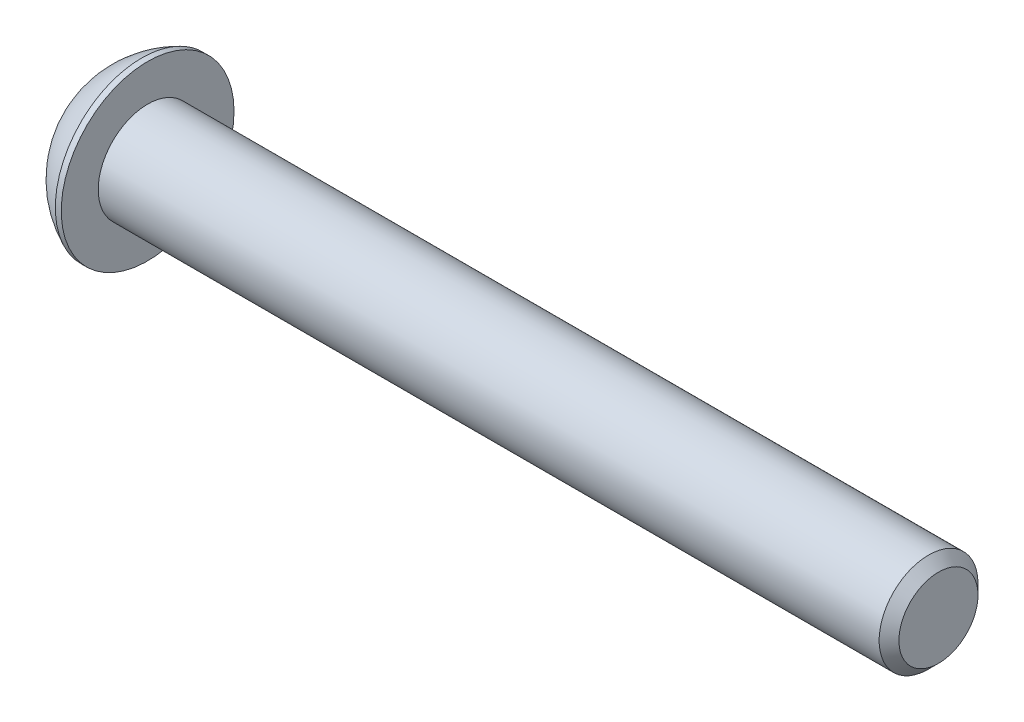
ISO-10303-21;
HEADER;
FILE_DESCRIPTION(('STEP AP214'),'2;1');
FILE_NAME('part.step','',(''),(''),'','','');
FILE_SCHEMA(('AUTOMOTIVE_DESIGN { 1 0 10303 214 1 1 1 1 }'));
ENDSEC;
DATA;
#1=APPLICATION_CONTEXT('core data for automotive mechanical design processes');
#2=APPLICATION_PROTOCOL_DEFINITION('international standard','automotive_design',2000,#1);
#3=PRODUCT_CONTEXT('',#1,'mechanical');
#4=PRODUCT('Part','Part','',(#3));
#5=PRODUCT_RELATED_PRODUCT_CATEGORY('part','',(#4));
#6=PRODUCT_DEFINITION_FORMATION('','',#4);
#7=PRODUCT_DEFINITION_CONTEXT('part definition',#1,'design');
#8=PRODUCT_DEFINITION('design','',#6,#7);
#9=PRODUCT_DEFINITION_SHAPE('','',#8);
#10=(LENGTH_UNIT() NAMED_UNIT(*) SI_UNIT(.MILLI.,.METRE.));
#11=(NAMED_UNIT(*) PLANE_ANGLE_UNIT() SI_UNIT($,.RADIAN.));
#12=(NAMED_UNIT(*) SI_UNIT($,.STERADIAN.) SOLID_ANGLE_UNIT());
#13=UNCERTAINTY_MEASURE_WITH_UNIT(LENGTH_MEASURE(1.E-05),#10,'distance_accuracy_value','');
#14=(GEOMETRIC_REPRESENTATION_CONTEXT(3) GLOBAL_UNCERTAINTY_ASSIGNED_CONTEXT((#13)) GLOBAL_UNIT_ASSIGNED_CONTEXT((#10,
#11,#12)) REPRESENTATION_CONTEXT('',''));
#15=CARTESIAN_POINT('',(0.,0.,0.));
#16=DIRECTION('',(0.,0.,1.));
#17=DIRECTION('',(1.,0.,0.));
#18=AXIS2_PLACEMENT_3D('',#15,#16,#17);
#19=CARTESIAN_POINT('',(1.32080000000034,0.,0.));
#20=DIRECTION('',(-1.,0.,0.));
#21=DIRECTION('',(0.,0.,-1.));
#22=AXIS2_PLACEMENT_3D('',#19,#20,#21);
#23=CONICAL_SURFACE('',#22,1.1937999999998,1.04719755119608);
#24=CARTESIAN_POINT('',(2.01004075135902,0.,4.44089209850063E-13));
#25=VERTEX_POINT('',#24);
#26=VERTEX_LOOP('',#25);
#27=FACE_BOUND('',#26,.T.);
#28=CARTESIAN_POINT('',(1.32080000000009,0.,0.));
#29=DIRECTION('',(1.,0.,0.));
#30=DIRECTION('',(0.,0.,-1.));
#31=AXIS2_PLACEMENT_3D('',#28,#29,#30);
#32=CIRCLE('',#31,1.19380000000024);
#33=CARTESIAN_POINT('',(1.32080000000009,0.,-1.19380000000024));
#34=VERTEX_POINT('',#33);
#35=EDGE_CURVE('E41',#34,#34,#32,.T.);
#36=ORIENTED_EDGE('',*,*,#35,.F.);
#37=EDGE_LOOP('',(#36));
#38=FACE_BOUND('',#37,.T.);
#39=ADVANCED_FACE('F38',(#27,#38),#23,.F.);
#40=CARTESIAN_POINT('',(1.3208,-2.29135888084633,0.));
#41=DIRECTION('',(1.,0.,0.));
#42=DIRECTION('',(0.,0.,1.));
#43=AXIS2_PLACEMENT_3D('',#40,#41,#42);
#44=PLANE('',#43);
#45=DIRECTION('',(0.,1.,0.));
#46=VECTOR('',#45,1.);
#47=CARTESIAN_POINT('',(1.3208,-1.14567944042316,-1.984375));
#48=LINE('',#47,#46);
#49=CARTESIAN_POINT('',(1.3208,1.14567944042316,-1.984375));
#50=VERTEX_POINT('',#49);
#51=CARTESIAN_POINT('',(1.3208,-1.14567944042316,-1.984375));
#52=VERTEX_POINT('',#51);
#53=EDGE_CURVE('E101',#50,#52,#48,.F.);
#54=ORIENTED_EDGE('',*,*,#53,.T.);
#55=DIRECTION('',(0.,0.500000000000001,-0.866025403784438));
#56=VECTOR('',#55,1.);
#57=CARTESIAN_POINT('',(1.3208,-2.29135888084633,0.));
#58=LINE('',#57,#56);
#59=CARTESIAN_POINT('',(1.3208,-2.29135888084633,0.));
#60=VERTEX_POINT('',#59);
#61=EDGE_CURVE('E107',#52,#60,#58,.F.);
#62=ORIENTED_EDGE('',*,*,#61,.T.);
#63=DIRECTION('',(0.,-0.500000000000001,-0.866025403784438));
#64=VECTOR('',#63,1.);
#65=CARTESIAN_POINT('',(1.3208,-1.14567944042316,1.984375));
#66=LINE('',#65,#64);
#67=CARTESIAN_POINT('',(1.3208,-1.14567944042316,1.984375));
#68=VERTEX_POINT('',#67);
#69=EDGE_CURVE('E171',#60,#68,#66,.F.);
#70=ORIENTED_EDGE('',*,*,#69,.T.);
#71=DIRECTION('',(0.,1.,0.));
#72=VECTOR('',#71,1.);
#73=CARTESIAN_POINT('',(1.3208,1.14567944042316,1.984375));
#74=LINE('',#73,#72);
#75=CARTESIAN_POINT('',(1.3208,1.14567944042316,1.984375));
#76=VERTEX_POINT('',#75);
#77=EDGE_CURVE('E166',#68,#76,#74,.T.);
#78=ORIENTED_EDGE('',*,*,#77,.T.);
#79=DIRECTION('',(0.,-0.5,0.866025403784439));
#80=VECTOR('',#79,1.);
#81=CARTESIAN_POINT('',(1.3208,2.29135888084633,0.));
#82=LINE('',#81,#80);
#83=CARTESIAN_POINT('',(1.3208,2.29135888084633,0.));
#84=VERTEX_POINT('',#83);
#85=EDGE_CURVE('E161',#76,#84,#82,.F.);
#86=ORIENTED_EDGE('',*,*,#85,.T.);
#87=DIRECTION('',(0.,0.5,0.866025403784439));
#88=VECTOR('',#87,1.);
#89=CARTESIAN_POINT('',(1.3208,1.14567944042316,-1.984375));
#90=LINE('',#89,#88);
#91=EDGE_CURVE('E157',#84,#50,#90,.F.);
#92=ORIENTED_EDGE('',*,*,#91,.T.);
#93=EDGE_LOOP('',(#54,#62,#70,#78,#86,#92));
#94=FACE_BOUND('',#93,.T.);
#95=ORIENTED_EDGE('',*,*,#35,.T.);
#96=EDGE_LOOP('',(#95));
#97=FACE_BOUND('',#96,.T.);
#98=ADVANCED_FACE('F97',(#94,#97),#44,.F.);
#99=CARTESIAN_POINT('',(1.3208,-1.14567944042316,-1.984375));
#100=DIRECTION('',(0.,0.,1.));
#101=DIRECTION('',(0.,1.,0.));
#102=AXIS2_PLACEMENT_3D('',#99,#100,#101);
#103=PLANE('',#102);
#104=ORIENTED_EDGE('',*,*,#53,.F.);
#105=DIRECTION('',(1.,0.,0.));
#106=VECTOR('',#105,1.);
#107=CARTESIAN_POINT('',(1.3208,1.14567944042316,-1.984375));
#108=LINE('',#107,#106);
#109=CARTESIAN_POINT('',(0.,1.14567944042316,-1.984375));
#110=VERTEX_POINT('',#109);
#111=EDGE_CURVE('E154',#50,#110,#108,.F.);
#112=ORIENTED_EDGE('',*,*,#111,.T.);
#113=DIRECTION('',(0.,1.,0.));
#114=VECTOR('',#113,1.);
#115=CARTESIAN_POINT('',(0.,0.,-1.984375));
#116=LINE('',#115,#114);
#117=CARTESIAN_POINT('',(0.,-1.14567944042316,-1.984375));
#118=VERTEX_POINT('',#117);
#119=EDGE_CURVE('E152',#110,#118,#116,.F.);
#120=ORIENTED_EDGE('',*,*,#119,.T.);
#121=DIRECTION('',(1.,0.,0.));
#122=VECTOR('',#121,1.);
#123=CARTESIAN_POINT('',(1.3208,-1.14567944042316,-1.984375));
#124=LINE('',#123,#122);
#125=EDGE_CURVE('E91',#118,#52,#124,.T.);
#126=ORIENTED_EDGE('',*,*,#125,.T.);
#127=EDGE_LOOP('',(#104,#112,#120,#126));
#128=FACE_BOUND('',#127,.T.);
#129=ADVANCED_FACE('F192',(#128),#103,.T.);
#130=CARTESIAN_POINT('',(1.3208,-2.29135888084633,0.));
#131=DIRECTION('',(0.,0.866025403784438,0.500000000000001));
#132=DIRECTION('',(0.,0.500000000000001,-0.866025403784438));
#133=AXIS2_PLACEMENT_3D('',#130,#131,#132);
#134=PLANE('',#133);
#135=ORIENTED_EDGE('',*,*,#61,.F.);
#136=ORIENTED_EDGE('',*,*,#125,.F.);
#137=DIRECTION('',(0.,-0.500000000000001,0.866025403784438));
#138=VECTOR('',#137,1.);
#139=CARTESIAN_POINT('',(0.,-1.14567944042316,-1.984375));
#140=LINE('',#139,#138);
#141=CARTESIAN_POINT('',(0.,-2.29135888084633,0.));
#142=VERTEX_POINT('',#141);
#143=EDGE_CURVE('E149',#118,#142,#140,.T.);
#144=ORIENTED_EDGE('',*,*,#143,.T.);
#145=DIRECTION('',(1.,0.,0.));
#146=VECTOR('',#145,1.);
#147=CARTESIAN_POINT('',(1.3208,-2.29135888084633,0.));
#148=LINE('',#147,#146);
#149=EDGE_CURVE('E174',#142,#60,#148,.T.);
#150=ORIENTED_EDGE('',*,*,#149,.T.);
#151=EDGE_LOOP('',(#135,#136,#144,#150));
#152=FACE_BOUND('',#151,.T.);
#153=ADVANCED_FACE('F177',(#152),#134,.T.);
#154=CARTESIAN_POINT('',(1.3208,-1.14567944042316,1.984375));
#155=DIRECTION('',(0.,0.866025403784438,-0.500000000000001));
#156=DIRECTION('',(0.,-0.500000000000001,-0.866025403784438));
#157=AXIS2_PLACEMENT_3D('',#154,#155,#156);
#158=PLANE('',#157);
#159=ORIENTED_EDGE('',*,*,#69,.F.);
#160=ORIENTED_EDGE('',*,*,#149,.F.);
#161=DIRECTION('',(0.,0.500000000000001,0.866025403784438));
#162=VECTOR('',#161,1.);
#163=CARTESIAN_POINT('',(0.,-2.29135888084633,0.));
#164=LINE('',#163,#162);
#165=CARTESIAN_POINT('',(0.,-1.14567944042316,1.984375));
#166=VERTEX_POINT('',#165);
#167=EDGE_CURVE('E146',#142,#166,#164,.T.);
#168=ORIENTED_EDGE('',*,*,#167,.T.);
#169=DIRECTION('',(1.,0.,0.));
#170=VECTOR('',#169,1.);
#171=CARTESIAN_POINT('',(1.3208,-1.14567944042316,1.984375));
#172=LINE('',#171,#170);
#173=EDGE_CURVE('E169',#166,#68,#172,.T.);
#174=ORIENTED_EDGE('',*,*,#173,.T.);
#175=EDGE_LOOP('',(#159,#160,#168,#174));
#176=FACE_BOUND('',#175,.T.);
#177=ADVANCED_FACE('F180',(#176),#158,.T.);
#178=CARTESIAN_POINT('',(1.3208,1.14567944042316,1.984375));
#179=DIRECTION('',(0.,0.,-1.));
#180=DIRECTION('',(1.,0.,0.));
#181=AXIS2_PLACEMENT_3D('',#178,#179,#180);
#182=PLANE('',#181);
#183=ORIENTED_EDGE('',*,*,#77,.F.);
#184=ORIENTED_EDGE('',*,*,#173,.F.);
#185=DIRECTION('',(0.,1.,0.));
#186=VECTOR('',#185,1.);
#187=CARTESIAN_POINT('',(0.,0.,1.984375));
#188=LINE('',#187,#186);
#189=CARTESIAN_POINT('',(0.,1.14567944042316,1.984375));
#190=VERTEX_POINT('',#189);
#191=EDGE_CURVE('E143',#166,#190,#188,.T.);
#192=ORIENTED_EDGE('',*,*,#191,.T.);
#193=DIRECTION('',(1.,0.,0.));
#194=VECTOR('',#193,1.);
#195=CARTESIAN_POINT('',(1.3208,1.14567944042316,1.984375));
#196=LINE('',#195,#194);
#197=EDGE_CURVE('E164',#190,#76,#196,.T.);
#198=ORIENTED_EDGE('',*,*,#197,.T.);
#199=EDGE_LOOP('',(#183,#184,#192,#198));
#200=FACE_BOUND('',#199,.T.);
#201=ADVANCED_FACE('F184',(#200),#182,.T.);
#202=CARTESIAN_POINT('',(1.3208,2.29135888084633,0.));
#203=DIRECTION('',(0.,-0.866025403784439,-0.5));
#204=DIRECTION('',(0.,-0.5,0.866025403784439));
#205=AXIS2_PLACEMENT_3D('',#202,#203,#204);
#206=PLANE('',#205);
#207=ORIENTED_EDGE('',*,*,#85,.F.);
#208=ORIENTED_EDGE('',*,*,#197,.F.);
#209=DIRECTION('',(0.,0.5,-0.866025403784439));
#210=VECTOR('',#209,1.);
#211=CARTESIAN_POINT('',(0.,1.14567944042316,1.984375));
#212=LINE('',#211,#210);
#213=CARTESIAN_POINT('',(0.,2.29135888084633,0.));
#214=VERTEX_POINT('',#213);
#215=EDGE_CURVE('E140',#190,#214,#212,.T.);
#216=ORIENTED_EDGE('',*,*,#215,.T.);
#217=DIRECTION('',(1.,0.,0.));
#218=VECTOR('',#217,1.);
#219=CARTESIAN_POINT('',(1.3208,2.29135888084633,0.));
#220=LINE('',#219,#218);
#221=EDGE_CURVE('E159',#214,#84,#220,.T.);
#222=ORIENTED_EDGE('',*,*,#221,.T.);
#223=EDGE_LOOP('',(#207,#208,#216,#222));
#224=FACE_BOUND('',#223,.T.);
#225=ADVANCED_FACE('F189',(#224),#206,.T.);
#226=CARTESIAN_POINT('',(1.3208,1.14567944042316,-1.984375));
#227=DIRECTION('',(0.,-0.866025403784439,0.5));
#228=DIRECTION('',(0.,0.5,0.866025403784439));
#229=AXIS2_PLACEMENT_3D('',#226,#227,#228);
#230=PLANE('',#229);
#231=ORIENTED_EDGE('',*,*,#91,.F.);
#232=ORIENTED_EDGE('',*,*,#221,.F.);
#233=DIRECTION('',(0.,-0.5,-0.866025403784438));
#234=VECTOR('',#233,1.);
#235=CARTESIAN_POINT('',(0.,2.29135888084633,0.));
#236=LINE('',#235,#234);
#237=EDGE_CURVE('E56',#214,#110,#236,.T.);
#238=ORIENTED_EDGE('',*,*,#237,.T.);
#239=ORIENTED_EDGE('',*,*,#111,.F.);
#240=EDGE_LOOP('',(#231,#232,#238,#239));
#241=FACE_BOUND('',#240,.T.);
#242=ADVANCED_FACE('F191',(#241),#230,.T.);
#243=CARTESIAN_POINT('',(0.,0.,0.));
#244=DIRECTION('',(-1.,0.,0.));
#245=DIRECTION('',(0.,0.,-1.));
#246=AXIS2_PLACEMENT_3D('',#243,#244,#245);
#247=PLANE('',#246);
#248=ORIENTED_EDGE('',*,*,#215,.F.);
#249=ORIENTED_EDGE('',*,*,#191,.F.);
#250=ORIENTED_EDGE('',*,*,#167,.F.);
#251=ORIENTED_EDGE('',*,*,#143,.F.);
#252=ORIENTED_EDGE('',*,*,#119,.F.);
#253=ORIENTED_EDGE('',*,*,#237,.F.);
#254=EDGE_LOOP('',(#248,#249,#250,#251,#252,#253));
#255=FACE_BOUND('',#254,.T.);
#256=CARTESIAN_POINT('',(0.,2.77495,0.));
#257=CARTESIAN_POINT('',(0.,2.77494953309947,-0.077911893752346));
#258=CARTESIAN_POINT('',(0.,2.77166578388025,-0.15583810591977));
#259=CARTESIAN_POINT('',(0.,2.75855213600204,-0.311152012455904));
#260=CARTESIAN_POINT('',(0.,2.74872030471467,-0.388539541019556));
#261=CARTESIAN_POINT('',(0.,2.72255472645677,-0.542341518735718));
#262=CARTESIAN_POINT('',(-2.70111753942276E-13,2.70621065843662,-0.618754223567578));
#263=CARTESIAN_POINT('',(2.71199122712048E-13,2.66713326915777,-0.769973634286023));
#264=CARTESIAN_POINT('',(1.01140160355389E-12,2.64439476297869,-0.844778983646282));
#265=CARTESIAN_POINT('',(1.81659311492368E-12,2.5669019594335,-1.06566239301792));
#266=CARTESIAN_POINT('',(4.76424972847466E-13,2.50280672569928,-1.20857954243987));
#267=CARTESIAN_POINT('',(-4.75575707467107E-13,2.35149826934097,-1.48160874561538));
#268=CARTESIAN_POINT('',(0.,2.26428416790396,-1.61172031233499));
#269=CARTESIAN_POINT('',(0.,2.1181093928834,-1.79445660654268));
#270=CARTESIAN_POINT('',(0.,2.06678693791626,-1.85333128513997));
#271=CARTESIAN_POINT('',(0.,1.95940522984449,-1.96650727912792));
#272=CARTESIAN_POINT('',(0.,1.90335059143535,-2.02081294920044));
#273=CARTESIAN_POINT('',(0.,1.78683891013962,-2.12453280878582));
#274=CARTESIAN_POINT('',(0.,1.72637988450322,-2.1739447713554));
#275=CARTESIAN_POINT('',(0.,1.6015196886571,-2.26750481692908));
#276=CARTESIAN_POINT('',(0.,1.53711760864537,-2.31165167810848));
#277=CARTESIAN_POINT('',(0.,1.33869902291632,-2.43567242603945));
#278=CARTESIAN_POINT('',(0.,1.19934704110695,-2.507235886628));
#279=CARTESIAN_POINT('',(0.,0.910681609121876,-2.62590828672821));
#280=CARTESIAN_POINT('',(0.,0.761368265357393,-2.67301748742279));
#281=CARTESIAN_POINT('',(0.,0.456932649466618,-2.74151230664007));
#282=CARTESIAN_POINT('',(0.,0.301810346322579,-2.76289778778721));
#283=CARTESIAN_POINT('',(0.,-0.00982263870895672,-2.77931595661156));
#284=CARTESIAN_POINT('',(0.,-0.166333320596453,-2.77434864428877));
#285=CARTESIAN_POINT('',(0.,-0.476280836814457,-2.73822217653073));
#286=CARTESIAN_POINT('',(0.,-0.62971768755599,-2.70706316096981));
#287=CARTESIAN_POINT('',(0.,-0.929254830044279,-2.6193798077115));
#288=CARTESIAN_POINT('',(0.,-1.0753550434132,-2.56285519909569));
#289=CARTESIAN_POINT('',(0.,-1.2857069259858,-2.46037024128109));
#290=CARTESIAN_POINT('',(0.,-1.35439130022287,-2.42323494812897));
#291=CARTESIAN_POINT('',(0.,-1.488391287199,-2.34331277270256));
#292=CARTESIAN_POINT('',(0.,-1.55370767631788,-2.30052720108832));
#293=CARTESIAN_POINT('',(0.,-1.68047292776595,-2.20962421887055));
#294=CARTESIAN_POINT('',(0.,-1.74192352786821,-2.16150923122349));
#295=CARTESIAN_POINT('',(0.,-1.86060297067993,-2.06024311301283));
#296=CARTESIAN_POINT('',(0.,-1.91782768181716,-2.00708716697631));
#297=CARTESIAN_POINT('',(0.,-2.08239462196652,-1.84072208565541));
#298=CARTESIAN_POINT('',(0.,-2.18279764272603,-1.72049499758423));
#299=CARTESIAN_POINT('',(0.,-2.36195754944064,-1.46487629213019));
#300=CARTESIAN_POINT('',(0.,-2.44071525816758,-1.32948525142808));
#301=CARTESIAN_POINT('',(0.,-2.54098882695275,-1.11796734074395));
#302=CARTESIAN_POINT('',(0.,-2.57146177392728,-1.04596540008348));
#303=CARTESIAN_POINT('',(0.,-2.62621251109,-0.899689259475771));
#304=CARTESIAN_POINT('',(0.,-2.65049531495565,-0.825416953360958));
#305=CARTESIAN_POINT('',(0.,-2.69267708798768,-0.675215808695211));
#306=CARTESIAN_POINT('',(0.,-2.71058613777938,-0.599289789313096));
#307=CARTESIAN_POINT('',(0.,-2.73994710360128,-0.446213628496935));
#308=CARTESIAN_POINT('',(0.,-2.75140092413872,-0.369063855024791));
#309=CARTESIAN_POINT('',(0.,-2.76470470685523,-0.243162088173433));
#310=CARTESIAN_POINT('',(0.,-2.76854547596619,-0.194611672428578));
#311=CARTESIAN_POINT('',(0.,-2.77366826843265,-0.097376035183982));
#312=CARTESIAN_POINT('',(0.,-2.77495029178815,-0.0486908136842399));
#313=CARTESIAN_POINT('',(0.,-2.77494953309948,0.0779118937523473));
#314=CARTESIAN_POINT('',(0.,-2.77166578388026,0.155838105919771));
#315=CARTESIAN_POINT('',(0.,-2.75855213600205,0.311152012455906));
#316=CARTESIAN_POINT('',(0.,-2.74872030471468,0.388539541019558));
#317=CARTESIAN_POINT('',(0.,-2.72255472645678,0.54234151873572));
#318=CARTESIAN_POINT('',(-2.70430332641579E-13,-2.70621065843663,0.618754223567581));
#319=CARTESIAN_POINT('',(2.71517960478941E-13,-2.66713326915778,0.769973634286026));
#320=CARTESIAN_POINT('',(1.01275560390505E-12,-2.6443947629787,0.844778983646286));
#321=CARTESIAN_POINT('',(1.81908746978714E-12,-2.56690195943352,1.06566239301793));
#322=CARTESIAN_POINT('',(4.77073664932017E-13,-2.50280672569929,1.20857954243988));
#323=CARTESIAN_POINT('',(-4.76224424213801E-13,-2.35149826934098,1.48160874561538));
#324=CARTESIAN_POINT('',(0.,-2.26428416790397,1.61172031233499));
#325=CARTESIAN_POINT('',(0.,-2.11810939288341,1.79445660654268));
#326=CARTESIAN_POINT('',(0.,-2.06678693791627,1.85333128513997));
#327=CARTESIAN_POINT('',(0.,-1.9594052298445,1.96650727912792));
#328=CARTESIAN_POINT('',(0.,-1.90335059143536,2.02081294920045));
#329=CARTESIAN_POINT('',(0.,-1.78683891013963,2.12453280878582));
#330=CARTESIAN_POINT('',(0.,-1.72637988450323,2.1739447713554));
#331=CARTESIAN_POINT('',(0.,-1.60151968865711,2.26750481692908));
#332=CARTESIAN_POINT('',(0.,-1.53711760864538,2.31165167810848));
#333=CARTESIAN_POINT('',(0.,-1.33869902291633,2.43567242603945));
#334=CARTESIAN_POINT('',(0.,-1.19934704110696,2.50723588662801));
#335=CARTESIAN_POINT('',(0.,-0.910681609121886,2.62590828672822));
#336=CARTESIAN_POINT('',(0.,-0.761368265357404,2.67301748742279));
#337=CARTESIAN_POINT('',(0.,-0.456932649466629,2.74151230664008));
#338=CARTESIAN_POINT('',(0.,-0.301810346322589,2.76289778778721));
#339=CARTESIAN_POINT('',(0.,0.00982263870894727,2.77931595661156));
#340=CARTESIAN_POINT('',(0.,0.166333320596444,2.77434864428877));
#341=CARTESIAN_POINT('',(0.,0.476280836814448,2.73822217653073));
#342=CARTESIAN_POINT('',(0.,0.629717687555981,2.70706316096981));
#343=CARTESIAN_POINT('',(0.,0.929254830044271,2.6193798077115));
#344=CARTESIAN_POINT('',(0.,1.07535504341319,2.56285519909569));
#345=CARTESIAN_POINT('',(0.,1.28570692598579,2.46037024128109));
#346=CARTESIAN_POINT('',(0.,1.35439130022286,2.42323494812896));
#347=CARTESIAN_POINT('',(0.,1.48839128719899,2.34331277270256));
#348=CARTESIAN_POINT('',(0.,1.55370767631787,2.30052720108832));
#349=CARTESIAN_POINT('',(0.,1.68047292776594,2.20962421887055));
#350=CARTESIAN_POINT('',(0.,1.7419235278682,2.16150923122349));
#351=CARTESIAN_POINT('',(0.,1.86060297067992,2.06024311301283));
#352=CARTESIAN_POINT('',(0.,1.91782768181715,2.0070871669763));
#353=CARTESIAN_POINT('',(0.,2.08239462196651,1.8407220856554));
#354=CARTESIAN_POINT('',(0.,2.18279764272601,1.72049499758422));
#355=CARTESIAN_POINT('',(0.,2.36195754944063,1.46487629213018));
#356=CARTESIAN_POINT('',(0.,2.44071525816758,1.32948525142808));
#357=CARTESIAN_POINT('',(0.,2.54098882695274,1.11796734074395));
#358=CARTESIAN_POINT('',(0.,2.57146177392727,1.04596540008348));
#359=CARTESIAN_POINT('',(0.,2.62621251108998,0.899689259475768));
#360=CARTESIAN_POINT('',(0.,2.65049531495563,0.825416953360955));
#361=CARTESIAN_POINT('',(0.,2.69267708798766,0.675215808695209));
#362=CARTESIAN_POINT('',(0.,2.71058613777937,0.599289789313094));
#363=CARTESIAN_POINT('',(0.,2.73994710360127,0.446213628496933));
#364=CARTESIAN_POINT('',(0.,2.7514009241387,0.369063855024788));
#365=CARTESIAN_POINT('',(0.,2.76470470685522,0.24316208817343));
#366=CARTESIAN_POINT('',(0.,2.76854547596618,0.194611672428576));
#367=CARTESIAN_POINT('',(0.,2.77366826843264,0.0973760351839819));
#368=CARTESIAN_POINT('',(0.,2.77495029178814,0.0486908136842405));
#369=CARTESIAN_POINT('',(0.,2.77495,0.));
#370=B_SPLINE_CURVE_WITH_KNOTS('',3,(#256,#257,#258,#259,#260,#261,#262,#263,#264,#265,#266,
#267,#268,#269,#270,#271,#272,#273,#274,#275,#276,#277,#278,#279,#280,#281,#282,#283,#284,#285,
#286,#287,#288,#289,#290,#291,#292,#293,#294,#295,#296,#297,#298,#299,#300,#301,#302,#303,#304,
#305,#306,#307,#308,#309,#310,#311,#312,#313,#314,#315,#316,#317,#318,#319,#320,#321,#322,#323,
#324,#325,#326,#327,#328,#329,#330,#331,#332,#333,#334,#335,#336,#337,#338,#339,#340,#341,#342,
#343,#344,#345,#346,#347,#348,#349,#350,#351,#352,#353,#354,#355,#356,#357,#358,#359,#360,#361,
#362,#363,#364,#365,#366,#367,#368,#369),.UNSPECIFIED.,.T.,.F.,(4,2,2,2,2,2,2,2,2,2,2,2,2,2,2,2,
2,2,2,2,2,2,2,2,2,2,2,2,2,2,2,2,2,2,2,2,2,2,2,2,2,2,2,2,2,2,2,2,2,2,2,2,2,2,2,2,4),(0.,
0.233690856748163,0.467450716578751,0.701582538521472,0.935904756015416,1.40343220467667,
1.87097742791502,2.10505636898837,2.33890962270652,2.57286880998746,2.80688218486307,
3.27442101763127,3.74195485676358,4.2094911927139,4.67702752866418,5.14456136779642,
5.61210020056469,5.84611357544034,6.08007276272137,6.3139260164395,6.54800495751273,
7.01555018075072,7.48307762941213,7.71739984690653,7.95153166884956,8.18529152868023,
8.41898238542856,8.56502681353349,8.71107124163844,8.9447620983866,9.17852195821719,
9.41265378015991,9.64697599765386,10.1145034463151,10.5820486695535,10.8161276106268,
11.049980864345,11.2839400516259,11.5179534265015,11.9854922592697,12.453026098402,
12.9205624343523,13.3880987703026,13.8556326094349,14.3231714422031,14.5571848170788,
14.7911440043598,15.0249972580779,15.2590761991512,15.7266214223892,16.1941488710506,
16.428471088545,16.662602910488,16.8963627703187,17.130053627067,17.2760980551719,
17.4221424832769),.UNSPECIFIED.);
#371=CARTESIAN_POINT('',(0.,2.77495,0.));
#372=VERTEX_POINT('',#371);
#373=EDGE_CURVE('E119',#372,#372,#370,.T.);
#374=ORIENTED_EDGE('',*,*,#373,.T.);
#375=EDGE_LOOP('',(#374));
#376=FACE_BOUND('',#375,.T.);
#377=ADVANCED_FACE('F125',(#255,#376),#247,.T.);
#378=CARTESIAN_POINT('',(5.37260881410257,0.,0.));
#379=DIRECTION('',(0.,1.,0.));
#380=DIRECTION('',(1.,0.,0.));
#381=AXIS2_PLACEMENT_3D('',#378,#379,#380);
#382=SPHERICAL_SURFACE('',#381,6.04692260343);
#383=CARTESIAN_POINT('',(2.9718,0.,0.));
#384=DIRECTION('',(1.,0.,0.));
#385=DIRECTION('',(0.,0.,-1.));
#386=AXIS2_PLACEMENT_3D('',#383,#384,#385);
#387=CIRCLE('',#386,5.5499);
#388=CARTESIAN_POINT('',(2.9718,0.,-5.5499));
#389=VERTEX_POINT('',#388);
#390=EDGE_CURVE('E117',#389,#389,#387,.F.);
#391=ORIENTED_EDGE('',*,*,#390,.T.);
#392=EDGE_LOOP('',(#391));
#393=FACE_BOUND('',#392,.T.);
#394=ORIENTED_EDGE('',*,*,#373,.F.);
#395=EDGE_LOOP('',(#394));
#396=FACE_BOUND('',#395,.T.);
#397=ADVANCED_FACE('F128',(#393,#396),#382,.T.);
#398=CARTESIAN_POINT('',(54.1528,0.,0.));
#399=DIRECTION('',(-1.,0.,0.));
#400=DIRECTION('',(0.,0.,-1.));
#401=AXIS2_PLACEMENT_3D('',#398,#399,#400);
#402=PLANE('',#401);
#403=CARTESIAN_POINT('',(54.1527999999971,0.,0.));
#404=DIRECTION('',(1.,0.,0.));
#405=DIRECTION('',(0.,0.,-1.));
#406=AXIS2_PLACEMENT_3D('',#403,#404,#405);
#407=CIRCLE('',#406,2.54000000006727);
#408=CARTESIAN_POINT('',(54.1527999999971,0.,-2.54000000006727));
#409=VERTEX_POINT('',#408);
#410=EDGE_CURVE('E114',#409,#409,#407,.T.);
#411=ORIENTED_EDGE('',*,*,#410,.T.);
#412=EDGE_LOOP('',(#411));
#413=FACE_BOUND('',#412,.T.);
#414=ADVANCED_FACE('F133',(#413),#402,.F.);
#415=CARTESIAN_POINT('',(0.,0.,0.));
#416=DIRECTION('',(-1.,0.,0.));
#417=DIRECTION('',(0.,0.,-1.));
#418=AXIS2_PLACEMENT_3D('',#415,#416,#417);
#419=CYLINDRICAL_SURFACE('',#418,5.5499);
#420=ORIENTED_EDGE('',*,*,#390,.F.);
#421=EDGE_LOOP('',(#420));
#422=FACE_BOUND('',#421,.T.);
#423=CARTESIAN_POINT('',(3.3528,0.,0.));
#424=DIRECTION('',(1.,0.,0.));
#425=DIRECTION('',(0.,0.,-1.));
#426=AXIS2_PLACEMENT_3D('',#423,#424,#425);
#427=CIRCLE('',#426,5.5499);
#428=CARTESIAN_POINT('',(3.3528,0.,-5.5499));
#429=VERTEX_POINT('',#428);
#430=EDGE_CURVE('E111',#429,#429,#427,.T.);
#431=ORIENTED_EDGE('',*,*,#430,.F.);
#432=EDGE_LOOP('',(#431));
#433=FACE_BOUND('',#432,.T.);
#434=ADVANCED_FACE('F266',(#422,#433),#419,.T.);
#435=CARTESIAN_POINT('',(53.5178000000656,0.,0.));
#436=DIRECTION('',(-1.,0.,0.));
#437=DIRECTION('',(0.,0.,-1.));
#438=AXIS2_PLACEMENT_3D('',#435,#436,#437);
#439=CONICAL_SURFACE('',#438,3.17499999999882,0.785398163397448);
#440=CARTESIAN_POINT('',(53.5178,0.,0.));
#441=DIRECTION('',(1.,0.,0.));
#442=DIRECTION('',(0.,0.,-1.));
#443=AXIS2_PLACEMENT_3D('',#440,#441,#442);
#444=CIRCLE('',#443,3.175);
#445=CARTESIAN_POINT('',(53.5178,0.,-3.175));
#446=VERTEX_POINT('',#445);
#447=EDGE_CURVE('E47',#446,#446,#444,.T.);
#448=ORIENTED_EDGE('',*,*,#447,.T.);
#449=EDGE_LOOP('',(#448));
#450=FACE_BOUND('',#449,.T.);
#451=ORIENTED_EDGE('',*,*,#410,.F.);
#452=EDGE_LOOP('',(#451));
#453=FACE_BOUND('',#452,.T.);
#454=ADVANCED_FACE('F275',(#450,#453),#439,.T.);
#455=CARTESIAN_POINT('',(3.3528,3.17499999999999,0.));
#456=DIRECTION('',(-1.,0.,0.));
#457=DIRECTION('',(0.,0.,-1.));
#458=AXIS2_PLACEMENT_3D('',#455,#456,#457);
#459=PLANE('',#458);
#460=CARTESIAN_POINT('',(3.3528,0.,0.));
#461=DIRECTION('',(1.,0.,0.));
#462=DIRECTION('',(0.,0.,-1.));
#463=AXIS2_PLACEMENT_3D('',#460,#461,#462);
#464=CIRCLE('',#463,3.175);
#465=CARTESIAN_POINT('',(3.3528,0.,-3.175));
#466=VERTEX_POINT('',#465);
#467=EDGE_CURVE('E11',#466,#466,#464,.F.);
#468=ORIENTED_EDGE('',*,*,#467,.T.);
#469=EDGE_LOOP('',(#468));
#470=FACE_BOUND('',#469,.T.);
#471=ORIENTED_EDGE('',*,*,#430,.T.);
#472=EDGE_LOOP('',(#471));
#473=FACE_BOUND('',#472,.T.);
#474=ADVANCED_FACE('F284',(#470,#473),#459,.F.);
#475=CARTESIAN_POINT('',(0.,0.,0.));
#476=DIRECTION('',(-1.,0.,0.));
#477=DIRECTION('',(0.,0.,-1.));
#478=AXIS2_PLACEMENT_3D('',#475,#476,#477);
#479=CYLINDRICAL_SURFACE('',#478,3.175);
#480=ORIENTED_EDGE('',*,*,#467,.F.);
#481=EDGE_LOOP('',(#480));
#482=FACE_BOUND('',#481,.T.);
#483=ORIENTED_EDGE('',*,*,#447,.F.);
#484=EDGE_LOOP('',(#483));
#485=FACE_BOUND('',#484,.T.);
#486=ADVANCED_FACE('F294',(#482,#485),#479,.T.);
#487=CLOSED_SHELL('',(#39,#98,#129,#153,#177,#201,#225,#242,#377,#397,#414,#434,#454,#474,#486));
#488=MANIFOLD_SOLID_BREP('B2',#487);
#489=ADVANCED_BREP_SHAPE_REPRESENTATION('',(#18,#488),#14);
#490=SHAPE_DEFINITION_REPRESENTATION(#9,#489);
ENDSEC;
END-ISO-10303-21;
